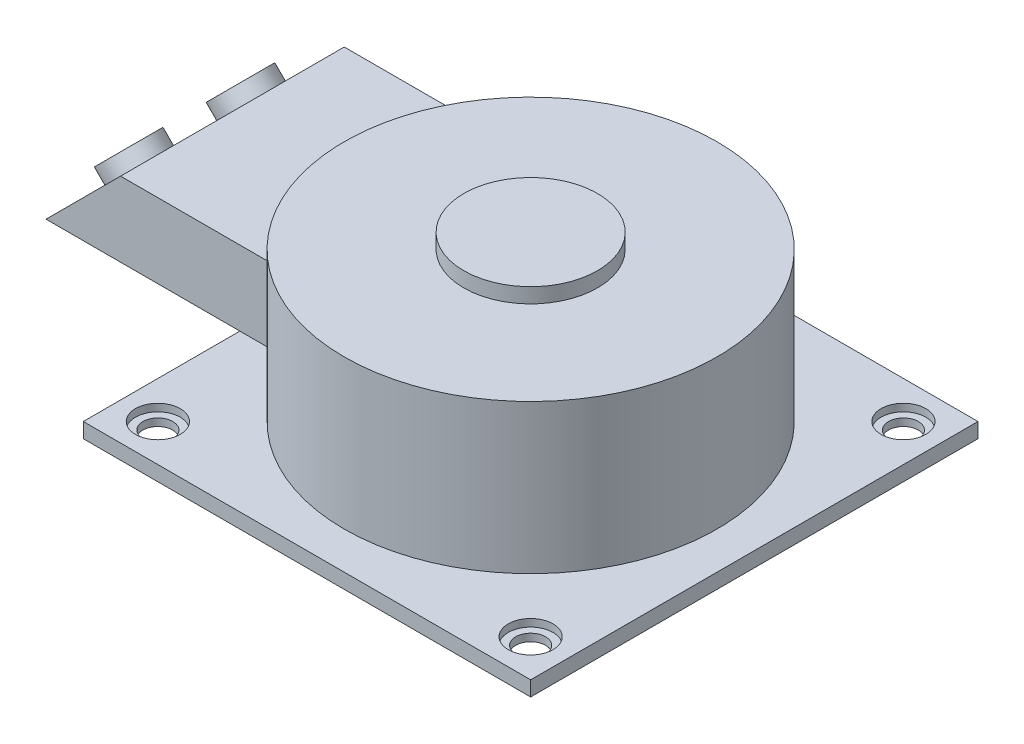
ISO-10303-21;
HEADER;
FILE_DESCRIPTION(('STEP AP214'),'2;1');
FILE_NAME('part.step','',(''),(''),'','','');
FILE_SCHEMA(('AUTOMOTIVE_DESIGN { 1 0 10303 214 1 1 1 1 }'));
ENDSEC;
DATA;
#1=APPLICATION_CONTEXT('core data for automotive mechanical design processes');
#2=APPLICATION_PROTOCOL_DEFINITION('international standard','automotive_design',2000,#1);
#3=PRODUCT_CONTEXT('',#1,'mechanical');
#4=PRODUCT('Part','Part','',(#3));
#5=PRODUCT_RELATED_PRODUCT_CATEGORY('part','',(#4));
#6=PRODUCT_DEFINITION_FORMATION('','',#4);
#7=PRODUCT_DEFINITION_CONTEXT('part definition',#1,'design');
#8=PRODUCT_DEFINITION('design','',#6,#7);
#9=PRODUCT_DEFINITION_SHAPE('','',#8);
#10=(LENGTH_UNIT() NAMED_UNIT(*) SI_UNIT(.MILLI.,.METRE.));
#11=(NAMED_UNIT(*) PLANE_ANGLE_UNIT() SI_UNIT($,.RADIAN.));
#12=(NAMED_UNIT(*) SI_UNIT($,.STERADIAN.) SOLID_ANGLE_UNIT());
#13=UNCERTAINTY_MEASURE_WITH_UNIT(LENGTH_MEASURE(1.E-05),#10,'distance_accuracy_value','');
#14=(GEOMETRIC_REPRESENTATION_CONTEXT(3) GLOBAL_UNCERTAINTY_ASSIGNED_CONTEXT((#13)) GLOBAL_UNIT_ASSIGNED_CONTEXT((#10,
#11,#12)) REPRESENTATION_CONTEXT('',''));
#15=CARTESIAN_POINT('',(0.,0.,0.));
#16=DIRECTION('',(0.,0.,1.));
#17=DIRECTION('',(1.,0.,0.));
#18=AXIS2_PLACEMENT_3D('',#15,#16,#17);
#19=CARTESIAN_POINT('',(150.,10.,150.));
#20=DIRECTION('',(-1.,0.,0.));
#21=DIRECTION('',(0.,0.,1.));
#22=AXIS2_PLACEMENT_3D('',#19,#20,#21);
#23=PLANE('',#22);
#24=DIRECTION('',(0.,0.,-1.));
#25=VECTOR('',#24,1.);
#26=CARTESIAN_POINT('',(150.,0.,150.));
#27=LINE('',#26,#25);
#28=CARTESIAN_POINT('',(150.,0.,150.));
#29=VERTEX_POINT('',#28);
#30=CARTESIAN_POINT('',(150.,0.,-150.));
#31=VERTEX_POINT('',#30);
#32=EDGE_CURVE('E128',#29,#31,#27,.T.);
#33=ORIENTED_EDGE('',*,*,#32,.T.);
#34=DIRECTION('',(0.,-1.,0.));
#35=VECTOR('',#34,1.);
#36=CARTESIAN_POINT('',(150.,10.,-150.));
#37=LINE('',#36,#35);
#38=CARTESIAN_POINT('',(150.,10.,-150.));
#39=VERTEX_POINT('',#38);
#40=EDGE_CURVE('E148',#39,#31,#37,.T.);
#41=ORIENTED_EDGE('',*,*,#40,.F.);
#42=DIRECTION('',(0.,0.,-1.));
#43=VECTOR('',#42,1.);
#44=CARTESIAN_POINT('',(150.,10.,150.));
#45=LINE('',#44,#43);
#46=CARTESIAN_POINT('',(150.,10.,150.));
#47=VERTEX_POINT('',#46);
#48=EDGE_CURVE('E123',#47,#39,#45,.T.);
#49=ORIENTED_EDGE('',*,*,#48,.F.);
#50=DIRECTION('',(0.,-1.,0.));
#51=VECTOR('',#50,1.);
#52=CARTESIAN_POINT('',(150.,10.,150.));
#53=LINE('',#52,#51);
#54=EDGE_CURVE('E118',#47,#29,#53,.T.);
#55=ORIENTED_EDGE('',*,*,#54,.T.);
#56=EDGE_LOOP('',(#33,#41,#49,#55));
#57=FACE_BOUND('',#56,.T.);
#58=ADVANCED_FACE('F35',(#57),#23,.F.);
#59=CARTESIAN_POINT('',(-150.,10.,-150.));
#60=DIRECTION('',(0.,0.,1.));
#61=DIRECTION('',(1.,0.,0.));
#62=AXIS2_PLACEMENT_3D('',#59,#60,#61);
#63=PLANE('',#62);
#64=DIRECTION('',(-1.,0.,0.));
#65=VECTOR('',#64,1.);
#66=CARTESIAN_POINT('',(-150.,0.,-150.));
#67=LINE('',#66,#65);
#68=CARTESIAN_POINT('',(-150.,0.,-150.));
#69=VERTEX_POINT('',#68);
#70=EDGE_CURVE('E133',#31,#69,#67,.T.);
#71=ORIENTED_EDGE('',*,*,#70,.T.);
#72=DIRECTION('',(0.,-1.,0.));
#73=VECTOR('',#72,1.);
#74=CARTESIAN_POINT('',(-150.,10.,-150.));
#75=LINE('',#74,#73);
#76=CARTESIAN_POINT('',(-150.,10.,-150.));
#77=VERTEX_POINT('',#76);
#78=EDGE_CURVE('E146',#77,#69,#75,.T.);
#79=ORIENTED_EDGE('',*,*,#78,.F.);
#80=DIRECTION('',(-1.,0.,0.));
#81=VECTOR('',#80,1.);
#82=CARTESIAN_POINT('',(-150.,10.,-150.));
#83=LINE('',#82,#81);
#84=EDGE_CURVE('E178',#39,#77,#83,.T.);
#85=ORIENTED_EDGE('',*,*,#84,.F.);
#86=ORIENTED_EDGE('',*,*,#40,.T.);
#87=EDGE_LOOP('',(#71,#79,#85,#86));
#88=FACE_BOUND('',#87,.T.);
#89=ADVANCED_FACE('F185',(#88),#63,.F.);
#90=CARTESIAN_POINT('',(-150.,10.,150.));
#91=DIRECTION('',(1.,0.,0.));
#92=DIRECTION('',(0.,0.,-1.));
#93=AXIS2_PLACEMENT_3D('',#90,#91,#92);
#94=PLANE('',#93);
#95=DIRECTION('',(0.,0.,1.));
#96=VECTOR('',#95,1.);
#97=CARTESIAN_POINT('',(-150.,0.,150.));
#98=LINE('',#97,#96);
#99=CARTESIAN_POINT('',(-150.,0.,150.));
#100=VERTEX_POINT('',#99);
#101=EDGE_CURVE('E108',#69,#100,#98,.T.);
#102=ORIENTED_EDGE('',*,*,#101,.T.);
#103=DIRECTION('',(0.,-1.,0.));
#104=VECTOR('',#103,1.);
#105=CARTESIAN_POINT('',(-150.,10.,150.));
#106=LINE('',#105,#104);
#107=CARTESIAN_POINT('',(-150.,10.,150.));
#108=VERTEX_POINT('',#107);
#109=EDGE_CURVE('E120',#108,#100,#106,.T.);
#110=ORIENTED_EDGE('',*,*,#109,.F.);
#111=DIRECTION('',(0.,0.,1.));
#112=VECTOR('',#111,1.);
#113=CARTESIAN_POINT('',(-150.,10.,150.));
#114=LINE('',#113,#112);
#115=EDGE_CURVE('E179',#77,#108,#114,.T.);
#116=ORIENTED_EDGE('',*,*,#115,.F.);
#117=ORIENTED_EDGE('',*,*,#78,.T.);
#118=EDGE_LOOP('',(#102,#110,#116,#117));
#119=FACE_BOUND('',#118,.T.);
#120=ADVANCED_FACE('F186',(#119),#94,.F.);
#121=CARTESIAN_POINT('',(-150.,10.,150.));
#122=DIRECTION('',(0.,0.,-1.));
#123=DIRECTION('',(-1.,0.,0.));
#124=AXIS2_PLACEMENT_3D('',#121,#122,#123);
#125=PLANE('',#124);
#126=DIRECTION('',(1.,0.,0.));
#127=VECTOR('',#126,1.);
#128=CARTESIAN_POINT('',(-150.,0.,150.));
#129=LINE('',#128,#127);
#130=EDGE_CURVE('E114',#100,#29,#129,.T.);
#131=ORIENTED_EDGE('',*,*,#130,.T.);
#132=ORIENTED_EDGE('',*,*,#54,.F.);
#133=DIRECTION('',(1.,0.,0.));
#134=VECTOR('',#133,1.);
#135=CARTESIAN_POINT('',(-150.,10.,150.));
#136=LINE('',#135,#134);
#137=EDGE_CURVE('E130',#108,#47,#136,.T.);
#138=ORIENTED_EDGE('',*,*,#137,.F.);
#139=ORIENTED_EDGE('',*,*,#109,.T.);
#140=EDGE_LOOP('',(#131,#132,#138,#139));
#141=FACE_BOUND('',#140,.T.);
#142=ADVANCED_FACE('F116',(#141),#125,.F.);
#143=CARTESIAN_POINT('',(0.,10.,0.));
#144=DIRECTION('',(0.,-1.,0.));
#145=DIRECTION('',(0.,0.,-1.));
#146=AXIS2_PLACEMENT_3D('',#143,#144,#145);
#147=PLANE('',#146);
#148=CARTESIAN_POINT('',(125.,10.,-125.));
#149=DIRECTION('',(0.,-1.,0.));
#150=DIRECTION('',(0.,0.,1.));
#151=AXIS2_PLACEMENT_3D('',#148,#149,#150);
#152=CIRCLE('',#151,15.);
#153=CARTESIAN_POINT('',(125.,10.,-110.));
#154=VERTEX_POINT('',#153);
#155=EDGE_CURVE('E487',#154,#154,#152,.T.);
#156=ORIENTED_EDGE('',*,*,#155,.T.);
#157=EDGE_LOOP('',(#156));
#158=FACE_BOUND('',#157,.T.);
#159=CARTESIAN_POINT('',(125.,10.,125.));
#160=DIRECTION('',(0.,1.,0.));
#161=DIRECTION('',(0.,0.,-1.));
#162=AXIS2_PLACEMENT_3D('',#159,#160,#161);
#163=CIRCLE('',#162,15.);
#164=CARTESIAN_POINT('',(125.,10.,110.));
#165=VERTEX_POINT('',#164);
#166=EDGE_CURVE('E501',#165,#165,#163,.T.);
#167=ORIENTED_EDGE('',*,*,#166,.F.);
#168=EDGE_LOOP('',(#167));
#169=FACE_BOUND('',#168,.T.);
#170=CARTESIAN_POINT('',(-125.,10.,125.));
#171=DIRECTION('',(0.,-1.,0.));
#172=DIRECTION('',(0.,0.,-1.));
#173=AXIS2_PLACEMENT_3D('',#170,#171,#172);
#174=CIRCLE('',#173,15.);
#175=CARTESIAN_POINT('',(-125.,10.,110.));
#176=VERTEX_POINT('',#175);
#177=EDGE_CURVE('E513',#176,#176,#174,.T.);
#178=ORIENTED_EDGE('',*,*,#177,.T.);
#179=EDGE_LOOP('',(#178));
#180=FACE_BOUND('',#179,.T.);
#181=CARTESIAN_POINT('',(-125.,10.,-125.));
#182=DIRECTION('',(0.,1.,0.));
#183=DIRECTION('',(0.,0.,1.));
#184=AXIS2_PLACEMENT_3D('',#181,#182,#183);
#185=CIRCLE('',#184,15.);
#186=CARTESIAN_POINT('',(-125.,10.,-110.));
#187=VERTEX_POINT('',#186);
#188=EDGE_CURVE('E525',#187,#187,#185,.T.);
#189=ORIENTED_EDGE('',*,*,#188,.F.);
#190=EDGE_LOOP('',(#189));
#191=FACE_BOUND('',#190,.T.);
#192=CARTESIAN_POINT('',(0.,9.99999999999999,0.));
#193=DIRECTION('',(0.,-1.,0.));
#194=DIRECTION('',(0.,0.,-1.));
#195=AXIS2_PLACEMENT_3D('',#192,#193,#194);
#196=CIRCLE('',#195,125.);
#197=CARTESIAN_POINT('',(0.,9.99999999999999,-125.));
#198=VERTEX_POINT('',#197);
#199=EDGE_CURVE('E150',#198,#198,#196,.F.);
#200=ORIENTED_EDGE('',*,*,#199,.F.);
#201=EDGE_LOOP('',(#200));
#202=FACE_BOUND('',#201,.T.);
#203=ORIENTED_EDGE('',*,*,#48,.T.);
#204=ORIENTED_EDGE('',*,*,#84,.T.);
#205=ORIENTED_EDGE('',*,*,#115,.T.);
#206=ORIENTED_EDGE('',*,*,#137,.T.);
#207=EDGE_LOOP('',(#203,#204,#205,#206));
#208=FACE_BOUND('',#207,.T.);
#209=ADVANCED_FACE('F182',(#158,#169,#180,#191,#202,#208),#147,.F.);
#210=CARTESIAN_POINT('',(0.,0.,0.));
#211=DIRECTION('',(0.,-1.,0.));
#212=DIRECTION('',(0.,0.,-1.));
#213=AXIS2_PLACEMENT_3D('',#210,#211,#212);
#214=PLANE('',#213);
#215=CARTESIAN_POINT('',(125.,0.,-125.));
#216=DIRECTION('',(0.,-1.,0.));
#217=DIRECTION('',(0.,0.,-1.));
#218=AXIS2_PLACEMENT_3D('',#215,#216,#217);
#219=CIRCLE('',#218,10.);
#220=CARTESIAN_POINT('',(125.,0.,-135.));
#221=VERTEX_POINT('',#220);
#222=EDGE_CURVE('E482',#221,#221,#219,.F.);
#223=ORIENTED_EDGE('',*,*,#222,.T.);
#224=EDGE_LOOP('',(#223));
#225=FACE_BOUND('',#224,.T.);
#226=CARTESIAN_POINT('',(125.,0.,125.));
#227=DIRECTION('',(0.,-1.,0.));
#228=DIRECTION('',(0.,0.,-1.));
#229=AXIS2_PLACEMENT_3D('',#226,#227,#228);
#230=CIRCLE('',#229,10.);
#231=CARTESIAN_POINT('',(125.,0.,115.));
#232=VERTEX_POINT('',#231);
#233=EDGE_CURVE('E498',#232,#232,#230,.T.);
#234=ORIENTED_EDGE('',*,*,#233,.F.);
#235=EDGE_LOOP('',(#234));
#236=FACE_BOUND('',#235,.T.);
#237=CARTESIAN_POINT('',(-125.,0.,125.));
#238=DIRECTION('',(0.,-1.,0.));
#239=DIRECTION('',(0.,0.,-1.));
#240=AXIS2_PLACEMENT_3D('',#237,#238,#239);
#241=CIRCLE('',#240,10.);
#242=CARTESIAN_POINT('',(-125.,0.,115.));
#243=VERTEX_POINT('',#242);
#244=EDGE_CURVE('E510',#243,#243,#241,.F.);
#245=ORIENTED_EDGE('',*,*,#244,.T.);
#246=EDGE_LOOP('',(#245));
#247=FACE_BOUND('',#246,.T.);
#248=CARTESIAN_POINT('',(-125.,0.,-125.));
#249=DIRECTION('',(0.,-1.,0.));
#250=DIRECTION('',(0.,0.,-1.));
#251=AXIS2_PLACEMENT_3D('',#248,#249,#250);
#252=CIRCLE('',#251,10.);
#253=CARTESIAN_POINT('',(-125.,0.,-135.));
#254=VERTEX_POINT('',#253);
#255=EDGE_CURVE('E522',#254,#254,#252,.T.);
#256=ORIENTED_EDGE('',*,*,#255,.F.);
#257=EDGE_LOOP('',(#256));
#258=FACE_BOUND('',#257,.T.);
#259=ORIENTED_EDGE('',*,*,#32,.F.);
#260=ORIENTED_EDGE('',*,*,#130,.F.);
#261=ORIENTED_EDGE('',*,*,#101,.F.);
#262=ORIENTED_EDGE('',*,*,#70,.F.);
#263=EDGE_LOOP('',(#259,#260,#261,#262));
#264=FACE_BOUND('',#263,.T.);
#265=ADVANCED_FACE('F132',(#225,#236,#247,#258,#264),#214,.T.);
#266=CARTESIAN_POINT('',(0.,110.,0.));
#267=DIRECTION('',(0.,-1.,0.));
#268=DIRECTION('',(0.,0.,-1.));
#269=AXIS2_PLACEMENT_3D('',#266,#267,#268);
#270=CYLINDRICAL_SURFACE('',#269,125.);
#271=CARTESIAN_POINT('',(0.,89.9999999999999,0.));
#272=DIRECTION('',(0.,1.,0.));
#273=DIRECTION('',(0.,0.,1.));
#274=AXIS2_PLACEMENT_3D('',#271,#272,#273);
#275=CIRCLE('',#274,125.);
#276=CARTESIAN_POINT('',(-100.,89.9999999999999,-75.));
#277=VERTEX_POINT('',#276);
#278=CARTESIAN_POINT('',(-100.,89.9999999999999,75.));
#279=VERTEX_POINT('',#278);
#280=EDGE_CURVE('E45',#277,#279,#275,.T.);
#281=ORIENTED_EDGE('',*,*,#280,.T.);
#282=DIRECTION('',(0.,-1.,0.));
#283=VECTOR('',#282,1.);
#284=CARTESIAN_POINT('',(-100.,110.,75.));
#285=LINE('',#284,#283);
#286=CARTESIAN_POINT('',(-100.,40.,75.));
#287=VERTEX_POINT('',#286);
#288=EDGE_CURVE('E11',#279,#287,#285,.T.);
#289=ORIENTED_EDGE('',*,*,#288,.T.);
#290=CARTESIAN_POINT('',(0.,40.,0.));
#291=DIRECTION('',(0.,-1.,0.));
#292=DIRECTION('',(0.,0.,-1.));
#293=AXIS2_PLACEMENT_3D('',#290,#291,#292);
#294=CIRCLE('',#293,125.);
#295=CARTESIAN_POINT('',(-100.,40.,-75.));
#296=VERTEX_POINT('',#295);
#297=EDGE_CURVE('E153',#287,#296,#294,.T.);
#298=ORIENTED_EDGE('',*,*,#297,.T.);
#299=DIRECTION('',(0.,-1.,0.));
#300=VECTOR('',#299,1.);
#301=CARTESIAN_POINT('',(-100.,110.,-75.));
#302=LINE('',#301,#300);
#303=EDGE_CURVE('E156',#296,#277,#302,.F.);
#304=ORIENTED_EDGE('',*,*,#303,.T.);
#305=EDGE_LOOP('',(#281,#289,#298,#304));
#306=FACE_BOUND('',#305,.T.);
#307=CARTESIAN_POINT('',(0.,110.,0.));
#308=DIRECTION('',(0.,1.,0.));
#309=DIRECTION('',(0.,0.,1.));
#310=AXIS2_PLACEMENT_3D('',#307,#308,#309);
#311=CIRCLE('',#310,125.);
#312=CARTESIAN_POINT('',(0.,110.,125.));
#313=VERTEX_POINT('',#312);
#314=EDGE_CURVE('E135',#313,#313,#311,.T.);
#315=ORIENTED_EDGE('',*,*,#314,.F.);
#316=EDGE_LOOP('',(#315));
#317=FACE_BOUND('',#316,.T.);
#318=ORIENTED_EDGE('',*,*,#199,.T.);
#319=EDGE_LOOP('',(#318));
#320=FACE_BOUND('',#319,.T.);
#321=ADVANCED_FACE('F219',(#306,#317,#320),#270,.T.);
#322=CARTESIAN_POINT('',(0.,110.,0.));
#323=DIRECTION('',(0.,1.,0.));
#324=DIRECTION('',(0.,0.,1.));
#325=AXIS2_PLACEMENT_3D('',#322,#323,#324);
#326=PLANE('',#325);
#327=CARTESIAN_POINT('',(0.,110.,0.));
#328=DIRECTION('',(0.,1.,0.));
#329=DIRECTION('',(0.,0.,1.));
#330=AXIS2_PLACEMENT_3D('',#327,#328,#329);
#331=CIRCLE('',#330,44.85);
#332=CARTESIAN_POINT('',(0.,110.,44.85));
#333=VERTEX_POINT('',#332);
#334=EDGE_CURVE('E529',#333,#333,#331,.T.);
#335=ORIENTED_EDGE('',*,*,#334,.F.);
#336=EDGE_LOOP('',(#335));
#337=FACE_BOUND('',#336,.T.);
#338=ORIENTED_EDGE('',*,*,#314,.T.);
#339=EDGE_LOOP('',(#338));
#340=FACE_BOUND('',#339,.T.);
#341=ADVANCED_FACE('F224',(#337,#340),#326,.T.);
#342=CARTESIAN_POINT('',(-200.,40.,75.));
#343=DIRECTION('',(0.,0.,1.));
#344=DIRECTION('',(1.,0.,0.));
#345=AXIS2_PLACEMENT_3D('',#342,#343,#344);
#346=PLANE('',#345);
#347=ORIENTED_EDGE('',*,*,#288,.F.);
#348=DIRECTION('',(1.,0.,0.));
#349=VECTOR('',#348,1.);
#350=CARTESIAN_POINT('',(-200.,89.9999999999999,75.));
#351=LINE('',#350,#349);
#352=CARTESIAN_POINT('',(-200.,89.9999999999999,75.));
#353=VERTEX_POINT('',#352);
#354=EDGE_CURVE('E139',#353,#279,#351,.T.);
#355=ORIENTED_EDGE('',*,*,#354,.F.);
#356=DIRECTION('',(-0.707106781186549,-0.707106781186546,0.));
#357=VECTOR('',#356,1.);
#358=CARTESIAN_POINT('',(-225.,65.,75.));
#359=LINE('',#358,#357);
#360=CARTESIAN_POINT('',(-250.,40.,75.));
#361=VERTEX_POINT('',#360);
#362=EDGE_CURVE('E161',#353,#361,#359,.T.);
#363=ORIENTED_EDGE('',*,*,#362,.T.);
#364=DIRECTION('',(1.,0.,0.));
#365=VECTOR('',#364,1.);
#366=CARTESIAN_POINT('',(-200.,40.,75.));
#367=LINE('',#366,#365);
#368=EDGE_CURVE('E65',#361,#287,#367,.T.);
#369=ORIENTED_EDGE('',*,*,#368,.T.);
#370=EDGE_LOOP('',(#347,#355,#363,#369));
#371=FACE_BOUND('',#370,.T.);
#372=ADVANCED_FACE('F249',(#371),#346,.T.);
#373=CARTESIAN_POINT('',(-200.,40.,-75.));
#374=DIRECTION('',(0.,0.,-1.));
#375=DIRECTION('',(-1.,0.,0.));
#376=AXIS2_PLACEMENT_3D('',#373,#374,#375);
#377=PLANE('',#376);
#378=ORIENTED_EDGE('',*,*,#303,.F.);
#379=DIRECTION('',(1.,0.,0.));
#380=VECTOR('',#379,1.);
#381=CARTESIAN_POINT('',(-200.,40.,-75.));
#382=LINE('',#381,#380);
#383=CARTESIAN_POINT('',(-250.,40.,-75.));
#384=VERTEX_POINT('',#383);
#385=EDGE_CURVE('E54',#384,#296,#382,.T.);
#386=ORIENTED_EDGE('',*,*,#385,.F.);
#387=DIRECTION('',(0.707106781186549,0.707106781186546,0.));
#388=VECTOR('',#387,1.);
#389=CARTESIAN_POINT('',(-225.,65.,-75.));
#390=LINE('',#389,#388);
#391=CARTESIAN_POINT('',(-200.,89.9999999999999,-75.));
#392=VERTEX_POINT('',#391);
#393=EDGE_CURVE('E39',#384,#392,#390,.T.);
#394=ORIENTED_EDGE('',*,*,#393,.T.);
#395=DIRECTION('',(1.,0.,0.));
#396=VECTOR('',#395,1.);
#397=CARTESIAN_POINT('',(-200.,89.9999999999999,-75.));
#398=LINE('',#397,#396);
#399=EDGE_CURVE('E78',#392,#277,#398,.T.);
#400=ORIENTED_EDGE('',*,*,#399,.T.);
#401=EDGE_LOOP('',(#378,#386,#394,#400));
#402=FACE_BOUND('',#401,.T.);
#403=ADVANCED_FACE('F240',(#402),#377,.T.);
#404=CARTESIAN_POINT('',(-200.,89.9999999999999,75.));
#405=DIRECTION('',(0.,1.,0.));
#406=DIRECTION('',(0.,0.,1.));
#407=AXIS2_PLACEMENT_3D('',#404,#405,#406);
#408=PLANE('',#407);
#409=ORIENTED_EDGE('',*,*,#280,.F.);
#410=ORIENTED_EDGE('',*,*,#399,.F.);
#411=DIRECTION('',(0.,0.,1.));
#412=VECTOR('',#411,1.);
#413=CARTESIAN_POINT('',(-200.,89.9999999999999,75.));
#414=LINE('',#413,#412);
#415=EDGE_CURVE('E165',#392,#353,#414,.T.);
#416=ORIENTED_EDGE('',*,*,#415,.T.);
#417=ORIENTED_EDGE('',*,*,#354,.T.);
#418=EDGE_LOOP('',(#409,#410,#416,#417));
#419=FACE_BOUND('',#418,.T.);
#420=ADVANCED_FACE('F234',(#419),#408,.T.);
#421=CARTESIAN_POINT('',(-200.,40.,75.));
#422=DIRECTION('',(0.,-1.,0.));
#423=DIRECTION('',(0.,0.,-1.));
#424=AXIS2_PLACEMENT_3D('',#421,#422,#423);
#425=PLANE('',#424);
#426=ORIENTED_EDGE('',*,*,#297,.F.);
#427=ORIENTED_EDGE('',*,*,#368,.F.);
#428=DIRECTION('',(0.,0.,-1.));
#429=VECTOR('',#428,1.);
#430=CARTESIAN_POINT('',(-250.,40.,75.));
#431=LINE('',#430,#429);
#432=EDGE_CURVE('E163',#361,#384,#431,.T.);
#433=ORIENTED_EDGE('',*,*,#432,.T.);
#434=ORIENTED_EDGE('',*,*,#385,.T.);
#435=EDGE_LOOP('',(#426,#427,#433,#434));
#436=FACE_BOUND('',#435,.T.);
#437=ADVANCED_FACE('F239',(#436),#425,.T.);
#438=CARTESIAN_POINT('',(-200.,89.9999999999999,75.));
#439=DIRECTION('',(-0.707106781186546,0.707106781186549,0.));
#440=DIRECTION('',(-0.707106781186549,-0.707106781186546,0.));
#441=AXIS2_PLACEMENT_3D('',#438,#439,#440);
#442=PLANE('',#441);
#443=CARTESIAN_POINT('',(-225.,64.9999999999999,37.5));
#444=DIRECTION('',(-0.707106781186546,0.707106781186549,0.));
#445=DIRECTION('',(0.707106781186549,0.707106781186546,0.));
#446=AXIS2_PLACEMENT_3D('',#443,#444,#445);
#447=CIRCLE('',#446,18.8);
#448=CARTESIAN_POINT('',(-211.706392513693,78.293607486307,37.5));
#449=VERTEX_POINT('',#448);
#450=EDGE_CURVE('E535',#449,#449,#447,.T.);
#451=ORIENTED_EDGE('',*,*,#450,.F.);
#452=EDGE_LOOP('',(#451));
#453=FACE_BOUND('',#452,.T.);
#454=CARTESIAN_POINT('',(-225.,64.9999999999999,-37.5));
#455=DIRECTION('',(-0.707106781186546,0.707106781186549,0.));
#456=DIRECTION('',(-0.707106781186549,-0.707106781186546,0.));
#457=AXIS2_PLACEMENT_3D('',#454,#455,#456);
#458=CIRCLE('',#457,18.8);
#459=CARTESIAN_POINT('',(-238.293607486307,51.7063925136929,-37.5));
#460=VERTEX_POINT('',#459);
#461=EDGE_CURVE('E172',#460,#460,#458,.T.);
#462=ORIENTED_EDGE('',*,*,#461,.F.);
#463=EDGE_LOOP('',(#462));
#464=FACE_BOUND('',#463,.T.);
#465=ORIENTED_EDGE('',*,*,#362,.F.);
#466=ORIENTED_EDGE('',*,*,#415,.F.);
#467=ORIENTED_EDGE('',*,*,#393,.F.);
#468=ORIENTED_EDGE('',*,*,#432,.F.);
#469=EDGE_LOOP('',(#465,#466,#467,#468));
#470=FACE_BOUND('',#469,.T.);
#471=ADVANCED_FACE('F37',(#453,#464,#470),#442,.T.);
#472=CARTESIAN_POINT('',(-232.071067811866,72.0710678118654,-37.5));
#473=DIRECTION('',(0.707106781186546,-0.707106781186549,0.));
#474=DIRECTION('',(0.707106781186549,0.707106781186546,0.));
#475=AXIS2_PLACEMENT_3D('',#472,#473,#474);
#476=CYLINDRICAL_SURFACE('',#475,18.8);
#477=CARTESIAN_POINT('',(-232.071067811866,72.0710678118654,-37.5));
#478=DIRECTION('',(-0.707106781186546,0.707106781186549,0.));
#479=DIRECTION('',(-0.707106781186549,-0.707106781186546,0.));
#480=AXIS2_PLACEMENT_3D('',#477,#478,#479);
#481=CIRCLE('',#480,18.8);
#482=CARTESIAN_POINT('',(-245.364675298173,58.7774603255584,-37.5));
#483=VERTEX_POINT('',#482);
#484=EDGE_CURVE('E164',#483,#483,#481,.T.);
#485=ORIENTED_EDGE('',*,*,#484,.F.);
#486=EDGE_LOOP('',(#485));
#487=FACE_BOUND('',#486,.T.);
#488=ORIENTED_EDGE('',*,*,#461,.T.);
#489=EDGE_LOOP('',(#488));
#490=FACE_BOUND('',#489,.T.);
#491=ADVANCED_FACE('F275',(#487,#490),#476,.T.);
#492=CARTESIAN_POINT('',(-232.071067811866,72.0710678118654,-37.5));
#493=DIRECTION('',(-0.707106781186546,0.707106781186549,0.));
#494=DIRECTION('',(-0.707106781186549,-0.707106781186546,0.));
#495=AXIS2_PLACEMENT_3D('',#492,#493,#494);
#496=PLANE('',#495);
#497=ORIENTED_EDGE('',*,*,#484,.T.);
#498=EDGE_LOOP('',(#497));
#499=FACE_BOUND('',#498,.T.);
#500=ADVANCED_FACE('F284',(#499),#496,.T.);
#501=CARTESIAN_POINT('',(-232.071067811866,72.0710678118654,37.5));
#502=DIRECTION('',(0.707106781186546,-0.707106781186549,0.));
#503=DIRECTION('',(0.707106781186549,0.707106781186546,0.));
#504=AXIS2_PLACEMENT_3D('',#501,#502,#503);
#505=CYLINDRICAL_SURFACE('',#504,18.8);
#506=CARTESIAN_POINT('',(-232.071067811866,72.0710678118654,37.5));
#507=DIRECTION('',(-0.707106781186546,0.707106781186549,0.));
#508=DIRECTION('',(0.707106781186549,0.707106781186546,0.));
#509=AXIS2_PLACEMENT_3D('',#506,#507,#508);
#510=CIRCLE('',#509,18.8);
#511=CARTESIAN_POINT('',(-218.777460325558,85.3646752981725,37.5));
#512=VERTEX_POINT('',#511);
#513=EDGE_CURVE('E538',#512,#512,#510,.T.);
#514=ORIENTED_EDGE('',*,*,#513,.F.);
#515=EDGE_LOOP('',(#514));
#516=FACE_BOUND('',#515,.T.);
#517=ORIENTED_EDGE('',*,*,#450,.T.);
#518=EDGE_LOOP('',(#517));
#519=FACE_BOUND('',#518,.T.);
#520=ADVANCED_FACE('F294',(#516,#519),#505,.T.);
#521=CARTESIAN_POINT('',(-232.071067811866,72.0710678118654,37.5));
#522=DIRECTION('',(0.707106781186546,-0.707106781186549,0.));
#523=DIRECTION('',(0.707106781186549,0.707106781186546,0.));
#524=AXIS2_PLACEMENT_3D('',#521,#522,#523);
#525=PLANE('',#524);
#526=ORIENTED_EDGE('',*,*,#513,.T.);
#527=EDGE_LOOP('',(#526));
#528=FACE_BOUND('',#527,.T.);
#529=ADVANCED_FACE('F304',(#528),#525,.F.);
#530=CARTESIAN_POINT('',(0.,120.,0.));
#531=DIRECTION('',(0.,-1.,0.));
#532=DIRECTION('',(0.,0.,-1.));
#533=AXIS2_PLACEMENT_3D('',#530,#531,#532);
#534=CYLINDRICAL_SURFACE('',#533,44.85);
#535=CARTESIAN_POINT('',(0.,120.,0.));
#536=DIRECTION('',(0.,1.,0.));
#537=DIRECTION('',(0.,0.,1.));
#538=AXIS2_PLACEMENT_3D('',#535,#536,#537);
#539=CIRCLE('',#538,44.85);
#540=CARTESIAN_POINT('',(0.,120.,44.85));
#541=VERTEX_POINT('',#540);
#542=EDGE_CURVE('E532',#541,#541,#539,.T.);
#543=ORIENTED_EDGE('',*,*,#542,.F.);
#544=EDGE_LOOP('',(#543));
#545=FACE_BOUND('',#544,.T.);
#546=ORIENTED_EDGE('',*,*,#334,.T.);
#547=EDGE_LOOP('',(#546));
#548=FACE_BOUND('',#547,.T.);
#549=ADVANCED_FACE('F314',(#545,#548),#534,.T.);
#550=CARTESIAN_POINT('',(0.,120.,0.));
#551=DIRECTION('',(0.,1.,0.));
#552=DIRECTION('',(0.,0.,1.));
#553=AXIS2_PLACEMENT_3D('',#550,#551,#552);
#554=PLANE('',#553);
#555=ORIENTED_EDGE('',*,*,#542,.T.);
#556=EDGE_LOOP('',(#555));
#557=FACE_BOUND('',#556,.T.);
#558=ADVANCED_FACE('F331',(#557),#554,.T.);
#559=CARTESIAN_POINT('',(-125.,5.,-125.));
#560=DIRECTION('',(0.,1.,0.));
#561=DIRECTION('',(0.,0.,1.));
#562=AXIS2_PLACEMENT_3D('',#559,#560,#561);
#563=CYLINDRICAL_SURFACE('',#562,15.);
#564=CARTESIAN_POINT('',(-125.,5.,-125.));
#565=DIRECTION('',(0.,1.,0.));
#566=DIRECTION('',(0.,0.,1.));
#567=AXIS2_PLACEMENT_3D('',#564,#565,#566);
#568=CIRCLE('',#567,15.);
#569=CARTESIAN_POINT('',(-125.,5.,-110.));
#570=VERTEX_POINT('',#569);
#571=EDGE_CURVE('E526',#570,#570,#568,.T.);
#572=ORIENTED_EDGE('',*,*,#571,.F.);
#573=EDGE_LOOP('',(#572));
#574=FACE_BOUND('',#573,.T.);
#575=ORIENTED_EDGE('',*,*,#188,.T.);
#576=EDGE_LOOP('',(#575));
#577=FACE_BOUND('',#576,.T.);
#578=ADVANCED_FACE('F341',(#574,#577),#563,.F.);
#579=CARTESIAN_POINT('',(-125.,5.,-125.));
#580=DIRECTION('',(0.,1.,0.));
#581=DIRECTION('',(0.,0.,1.));
#582=AXIS2_PLACEMENT_3D('',#579,#580,#581);
#583=PLANE('',#582);
#584=CARTESIAN_POINT('',(-125.,5.,-125.));
#585=DIRECTION('',(0.,1.,0.));
#586=DIRECTION('',(0.,0.,1.));
#587=AXIS2_PLACEMENT_3D('',#584,#585,#586);
#588=CIRCLE('',#587,10.);
#589=CARTESIAN_POINT('',(-125.,5.,-115.));
#590=VERTEX_POINT('',#589);
#591=EDGE_CURVE('E517',#590,#590,#588,.T.);
#592=ORIENTED_EDGE('',*,*,#591,.F.);
#593=EDGE_LOOP('',(#592));
#594=FACE_BOUND('',#593,.T.);
#595=ORIENTED_EDGE('',*,*,#571,.T.);
#596=EDGE_LOOP('',(#595));
#597=FACE_BOUND('',#596,.T.);
#598=ADVANCED_FACE('F351',(#594,#597),#583,.T.);
#599=CARTESIAN_POINT('',(-125.,-20.,-125.));
#600=DIRECTION('',(0.,1.,0.));
#601=DIRECTION('',(0.,0.,1.));
#602=AXIS2_PLACEMENT_3D('',#599,#600,#601);
#603=CYLINDRICAL_SURFACE('',#602,10.);
#604=ORIENTED_EDGE('',*,*,#255,.T.);
#605=EDGE_LOOP('',(#604));
#606=FACE_BOUND('',#605,.T.);
#607=ORIENTED_EDGE('',*,*,#591,.T.);
#608=EDGE_LOOP('',(#607));
#609=FACE_BOUND('',#608,.T.);
#610=ADVANCED_FACE('F361',(#606,#609),#603,.F.);
#611=CARTESIAN_POINT('',(-125.,5.,125.));
#612=DIRECTION('',(0.,1.,0.));
#613=DIRECTION('',(0.,0.,1.));
#614=AXIS2_PLACEMENT_3D('',#611,#612,#613);
#615=CYLINDRICAL_SURFACE('',#614,15.);
#616=CARTESIAN_POINT('',(-125.,5.,125.));
#617=DIRECTION('',(0.,-1.,0.));
#618=DIRECTION('',(0.,0.,-1.));
#619=AXIS2_PLACEMENT_3D('',#616,#617,#618);
#620=CIRCLE('',#619,15.);
#621=CARTESIAN_POINT('',(-125.,5.,110.));
#622=VERTEX_POINT('',#621);
#623=EDGE_CURVE('E514',#622,#622,#620,.T.);
#624=ORIENTED_EDGE('',*,*,#623,.T.);
#625=EDGE_LOOP('',(#624));
#626=FACE_BOUND('',#625,.T.);
#627=ORIENTED_EDGE('',*,*,#177,.F.);
#628=EDGE_LOOP('',(#627));
#629=FACE_BOUND('',#628,.T.);
#630=ADVANCED_FACE('F371',(#626,#629),#615,.F.);
#631=CARTESIAN_POINT('',(-125.,5.,125.));
#632=DIRECTION('',(0.,1.,0.));
#633=DIRECTION('',(0.,0.,-1.));
#634=AXIS2_PLACEMENT_3D('',#631,#632,#633);
#635=PLANE('',#634);
#636=CARTESIAN_POINT('',(-125.,5.,125.));
#637=DIRECTION('',(0.,-1.,0.));
#638=DIRECTION('',(0.,0.,-1.));
#639=AXIS2_PLACEMENT_3D('',#636,#637,#638);
#640=CIRCLE('',#639,10.);
#641=CARTESIAN_POINT('',(-125.,5.,115.));
#642=VERTEX_POINT('',#641);
#643=EDGE_CURVE('E505',#642,#642,#640,.T.);
#644=ORIENTED_EDGE('',*,*,#643,.T.);
#645=EDGE_LOOP('',(#644));
#646=FACE_BOUND('',#645,.T.);
#647=ORIENTED_EDGE('',*,*,#623,.F.);
#648=EDGE_LOOP('',(#647));
#649=FACE_BOUND('',#648,.T.);
#650=ADVANCED_FACE('F381',(#646,#649),#635,.T.);
#651=CARTESIAN_POINT('',(-125.,-20.,125.));
#652=DIRECTION('',(0.,1.,0.));
#653=DIRECTION('',(0.,0.,1.));
#654=AXIS2_PLACEMENT_3D('',#651,#652,#653);
#655=CYLINDRICAL_SURFACE('',#654,10.);
#656=ORIENTED_EDGE('',*,*,#244,.F.);
#657=EDGE_LOOP('',(#656));
#658=FACE_BOUND('',#657,.T.);
#659=ORIENTED_EDGE('',*,*,#643,.F.);
#660=EDGE_LOOP('',(#659));
#661=FACE_BOUND('',#660,.T.);
#662=ADVANCED_FACE('F391',(#658,#661),#655,.F.);
#663=CARTESIAN_POINT('',(125.,5.,125.));
#664=DIRECTION('',(0.,1.,0.));
#665=DIRECTION('',(0.,0.,1.));
#666=AXIS2_PLACEMENT_3D('',#663,#664,#665);
#667=CYLINDRICAL_SURFACE('',#666,15.);
#668=CARTESIAN_POINT('',(125.,5.,125.));
#669=DIRECTION('',(0.,1.,0.));
#670=DIRECTION('',(0.,0.,-1.));
#671=AXIS2_PLACEMENT_3D('',#668,#669,#670);
#672=CIRCLE('',#671,15.);
#673=CARTESIAN_POINT('',(125.,5.,110.));
#674=VERTEX_POINT('',#673);
#675=EDGE_CURVE('E502',#674,#674,#672,.T.);
#676=ORIENTED_EDGE('',*,*,#675,.F.);
#677=EDGE_LOOP('',(#676));
#678=FACE_BOUND('',#677,.T.);
#679=ORIENTED_EDGE('',*,*,#166,.T.);
#680=EDGE_LOOP('',(#679));
#681=FACE_BOUND('',#680,.T.);
#682=ADVANCED_FACE('F401',(#678,#681),#667,.F.);
#683=CARTESIAN_POINT('',(125.,5.,125.));
#684=DIRECTION('',(0.,1.,0.));
#685=DIRECTION('',(0.,0.,-1.));
#686=AXIS2_PLACEMENT_3D('',#683,#684,#685);
#687=PLANE('',#686);
#688=CARTESIAN_POINT('',(125.,5.,125.));
#689=DIRECTION('',(0.,1.,0.));
#690=DIRECTION('',(0.,0.,-1.));
#691=AXIS2_PLACEMENT_3D('',#688,#689,#690);
#692=CIRCLE('',#691,10.);
#693=CARTESIAN_POINT('',(125.,5.,115.));
#694=VERTEX_POINT('',#693);
#695=EDGE_CURVE('E493',#694,#694,#692,.T.);
#696=ORIENTED_EDGE('',*,*,#695,.F.);
#697=EDGE_LOOP('',(#696));
#698=FACE_BOUND('',#697,.T.);
#699=ORIENTED_EDGE('',*,*,#675,.T.);
#700=EDGE_LOOP('',(#699));
#701=FACE_BOUND('',#700,.T.);
#702=ADVANCED_FACE('F425',(#698,#701),#687,.T.);
#703=CARTESIAN_POINT('',(125.,-20.,125.));
#704=DIRECTION('',(0.,1.,0.));
#705=DIRECTION('',(0.,0.,1.));
#706=AXIS2_PLACEMENT_3D('',#703,#704,#705);
#707=CYLINDRICAL_SURFACE('',#706,10.);
#708=ORIENTED_EDGE('',*,*,#233,.T.);
#709=EDGE_LOOP('',(#708));
#710=FACE_BOUND('',#709,.T.);
#711=ORIENTED_EDGE('',*,*,#695,.T.);
#712=EDGE_LOOP('',(#711));
#713=FACE_BOUND('',#712,.T.);
#714=ADVANCED_FACE('F435',(#710,#713),#707,.F.);
#715=CARTESIAN_POINT('',(125.,5.,-125.));
#716=DIRECTION('',(0.,1.,0.));
#717=DIRECTION('',(0.,0.,1.));
#718=AXIS2_PLACEMENT_3D('',#715,#716,#717);
#719=CYLINDRICAL_SURFACE('',#718,15.);
#720=CARTESIAN_POINT('',(125.,5.,-125.));
#721=DIRECTION('',(0.,-1.,0.));
#722=DIRECTION('',(0.,0.,1.));
#723=AXIS2_PLACEMENT_3D('',#720,#721,#722);
#724=CIRCLE('',#723,15.);
#725=CARTESIAN_POINT('',(125.,5.,-110.));
#726=VERTEX_POINT('',#725);
#727=EDGE_CURVE('E490',#726,#726,#724,.T.);
#728=ORIENTED_EDGE('',*,*,#727,.T.);
#729=EDGE_LOOP('',(#728));
#730=FACE_BOUND('',#729,.T.);
#731=ORIENTED_EDGE('',*,*,#155,.F.);
#732=EDGE_LOOP('',(#731));
#733=FACE_BOUND('',#732,.T.);
#734=ADVANCED_FACE('F445',(#730,#733),#719,.F.);
#735=CARTESIAN_POINT('',(125.,5.,-125.));
#736=DIRECTION('',(0.,1.,0.));
#737=DIRECTION('',(0.,0.,1.));
#738=AXIS2_PLACEMENT_3D('',#735,#736,#737);
#739=PLANE('',#738);
#740=CARTESIAN_POINT('',(125.,5.,-125.));
#741=DIRECTION('',(0.,-1.,0.));
#742=DIRECTION('',(0.,0.,1.));
#743=AXIS2_PLACEMENT_3D('',#740,#741,#742);
#744=CIRCLE('',#743,10.);
#745=CARTESIAN_POINT('',(125.,5.,-115.));
#746=VERTEX_POINT('',#745);
#747=EDGE_CURVE('E485',#746,#746,#744,.T.);
#748=ORIENTED_EDGE('',*,*,#747,.T.);
#749=EDGE_LOOP('',(#748));
#750=FACE_BOUND('',#749,.T.);
#751=ORIENTED_EDGE('',*,*,#727,.F.);
#752=EDGE_LOOP('',(#751));
#753=FACE_BOUND('',#752,.T.);
#754=ADVANCED_FACE('F455',(#750,#753),#739,.T.);
#755=CARTESIAN_POINT('',(125.,-20.,-125.));
#756=DIRECTION('',(0.,1.,0.));
#757=DIRECTION('',(0.,0.,1.));
#758=AXIS2_PLACEMENT_3D('',#755,#756,#757);
#759=CYLINDRICAL_SURFACE('',#758,10.);
#760=ORIENTED_EDGE('',*,*,#222,.F.);
#761=EDGE_LOOP('',(#760));
#762=FACE_BOUND('',#761,.T.);
#763=ORIENTED_EDGE('',*,*,#747,.F.);
#764=EDGE_LOOP('',(#763));
#765=FACE_BOUND('',#764,.T.);
#766=ADVANCED_FACE('F465',(#762,#765),#759,.F.);
#767=CLOSED_SHELL('',(#58,#89,#120,#142,#209,#265,#321,#341,#372,#403,#420,#437,#471,#491,#500,
#520,#529,#549,#558,#578,#598,#610,#630,#650,#662,#682,#702,#714,#734,#754,#766));
#768=MANIFOLD_SOLID_BREP('B2',#767);
#769=ADVANCED_BREP_SHAPE_REPRESENTATION('',(#18,#768),#14);
#770=SHAPE_DEFINITION_REPRESENTATION(#9,#769);
ENDSEC;
END-ISO-10303-21;
